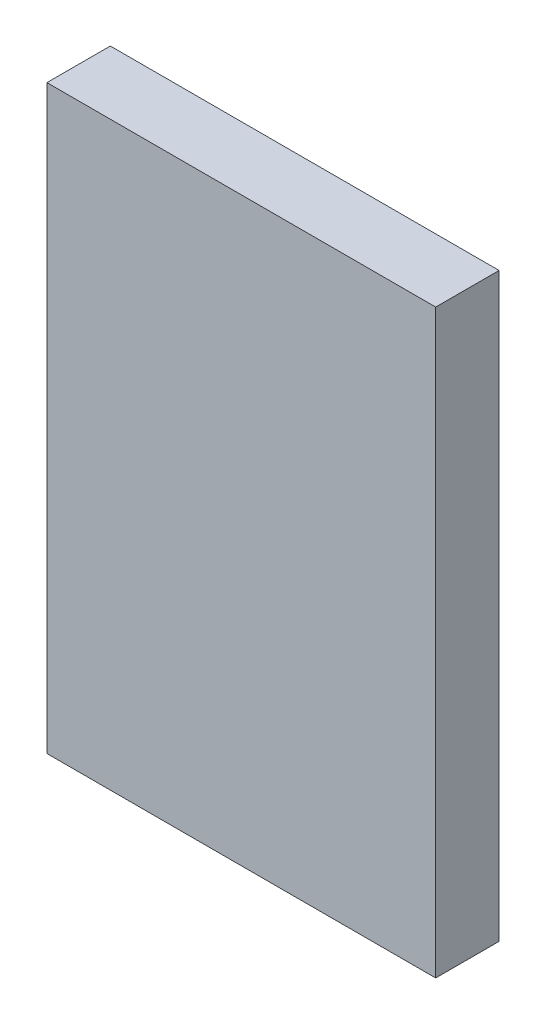
ISO-10303-21;
HEADER;
FILE_DESCRIPTION(('STEP AP214'),'2;1');
FILE_NAME('part.step','',(''),(''),'','','');
FILE_SCHEMA(('AUTOMOTIVE_DESIGN { 1 0 10303 214 1 1 1 1 }'));
ENDSEC;
DATA;
#1=APPLICATION_CONTEXT('core data for automotive mechanical design processes');
#2=APPLICATION_PROTOCOL_DEFINITION('international standard','automotive_design',2000,#1);
#3=PRODUCT_CONTEXT('',#1,'mechanical');
#4=PRODUCT('Part','Part','',(#3));
#5=PRODUCT_RELATED_PRODUCT_CATEGORY('part','',(#4));
#6=PRODUCT_DEFINITION_FORMATION('','',#4);
#7=PRODUCT_DEFINITION_CONTEXT('part definition',#1,'design');
#8=PRODUCT_DEFINITION('design','',#6,#7);
#9=PRODUCT_DEFINITION_SHAPE('','',#8);
#10=(LENGTH_UNIT() NAMED_UNIT(*) SI_UNIT(.MILLI.,.METRE.));
#11=(NAMED_UNIT(*) PLANE_ANGLE_UNIT() SI_UNIT($,.RADIAN.));
#12=(NAMED_UNIT(*) SI_UNIT($,.STERADIAN.) SOLID_ANGLE_UNIT());
#13=UNCERTAINTY_MEASURE_WITH_UNIT(LENGTH_MEASURE(1.E-05),#10,'distance_accuracy_value','');
#14=(GEOMETRIC_REPRESENTATION_CONTEXT(3) GLOBAL_UNCERTAINTY_ASSIGNED_CONTEXT((#13)) GLOBAL_UNIT_ASSIGNED_CONTEXT((#10,
#11,#12)) REPRESENTATION_CONTEXT('',''));
#15=CARTESIAN_POINT('',(0.,0.,0.));
#16=DIRECTION('',(0.,0.,1.));
#17=DIRECTION('',(1.,0.,0.));
#18=AXIS2_PLACEMENT_3D('',#15,#16,#17);
#19=CARTESIAN_POINT('',(27.6,-41.25,9.));
#20=DIRECTION('',(-1.,0.,0.));
#21=DIRECTION('',(0.,0.,1.));
#22=AXIS2_PLACEMENT_3D('',#19,#20,#21);
#23=PLANE('',#22);
#24=DIRECTION('',(0.,1.,0.));
#25=VECTOR('',#24,1.);
#26=CARTESIAN_POINT('',(27.6,-41.25,0.));
#27=LINE('',#26,#25);
#28=CARTESIAN_POINT('',(27.6,-41.25,0.));
#29=VERTEX_POINT('',#28);
#30=CARTESIAN_POINT('',(27.6,41.25,0.));
#31=VERTEX_POINT('',#30);
#32=EDGE_CURVE('E96',#29,#31,#27,.T.);
#33=ORIENTED_EDGE('',*,*,#32,.T.);
#34=DIRECTION('',(0.,0.,-1.));
#35=VECTOR('',#34,1.);
#36=CARTESIAN_POINT('',(27.6,41.25,9.));
#37=LINE('',#36,#35);
#38=CARTESIAN_POINT('',(27.6,41.25,9.));
#39=VERTEX_POINT('',#38);
#40=EDGE_CURVE('E11',#39,#31,#37,.T.);
#41=ORIENTED_EDGE('',*,*,#40,.F.);
#42=DIRECTION('',(0.,1.,0.));
#43=VECTOR('',#42,1.);
#44=CARTESIAN_POINT('',(27.6,-41.25,9.));
#45=LINE('',#44,#43);
#46=CARTESIAN_POINT('',(27.6,-41.25,9.));
#47=VERTEX_POINT('',#46);
#48=EDGE_CURVE('E84',#47,#39,#45,.T.);
#49=ORIENTED_EDGE('',*,*,#48,.F.);
#50=DIRECTION('',(0.,0.,-1.));
#51=VECTOR('',#50,1.);
#52=CARTESIAN_POINT('',(27.6,-41.25,9.));
#53=LINE('',#52,#51);
#54=EDGE_CURVE('E92',#47,#29,#53,.T.);
#55=ORIENTED_EDGE('',*,*,#54,.T.);
#56=EDGE_LOOP('',(#33,#41,#49,#55));
#57=FACE_BOUND('',#56,.T.);
#58=ADVANCED_FACE('F33',(#57),#23,.F.);
#59=CARTESIAN_POINT('',(-27.6,41.25,9.));
#60=DIRECTION('',(0.,-1.,0.));
#61=DIRECTION('',(0.,0.,-1.));
#62=AXIS2_PLACEMENT_3D('',#59,#60,#61);
#63=PLANE('',#62);
#64=DIRECTION('',(-1.,0.,0.));
#65=VECTOR('',#64,1.);
#66=CARTESIAN_POINT('',(-27.6,41.25,0.));
#67=LINE('',#66,#65);
#68=CARTESIAN_POINT('',(-27.6,41.25,0.));
#69=VERTEX_POINT('',#68);
#70=EDGE_CURVE('E88',#31,#69,#67,.T.);
#71=ORIENTED_EDGE('',*,*,#70,.T.);
#72=DIRECTION('',(0.,0.,-1.));
#73=VECTOR('',#72,1.);
#74=CARTESIAN_POINT('',(-27.6,41.25,9.));
#75=LINE('',#74,#73);
#76=CARTESIAN_POINT('',(-27.6,41.25,9.));
#77=VERTEX_POINT('',#76);
#78=EDGE_CURVE('E41',#77,#69,#75,.T.);
#79=ORIENTED_EDGE('',*,*,#78,.F.);
#80=DIRECTION('',(-1.,0.,0.));
#81=VECTOR('',#80,1.);
#82=CARTESIAN_POINT('',(-27.6,41.25,9.));
#83=LINE('',#82,#81);
#84=EDGE_CURVE('E79',#39,#77,#83,.T.);
#85=ORIENTED_EDGE('',*,*,#84,.F.);
#86=ORIENTED_EDGE('',*,*,#40,.T.);
#87=EDGE_LOOP('',(#71,#79,#85,#86));
#88=FACE_BOUND('',#87,.T.);
#89=ADVANCED_FACE('F87',(#88),#63,.F.);
#90=CARTESIAN_POINT('',(-27.6,-41.25,9.));
#91=DIRECTION('',(1.,0.,0.));
#92=DIRECTION('',(0.,0.,-1.));
#93=AXIS2_PLACEMENT_3D('',#90,#91,#92);
#94=PLANE('',#93);
#95=DIRECTION('',(0.,-1.,0.));
#96=VECTOR('',#95,1.);
#97=CARTESIAN_POINT('',(-27.6,-41.25,0.));
#98=LINE('',#97,#96);
#99=CARTESIAN_POINT('',(-27.6,-41.25,0.));
#100=VERTEX_POINT('',#99);
#101=EDGE_CURVE('E66',#69,#100,#98,.T.);
#102=ORIENTED_EDGE('',*,*,#101,.T.);
#103=DIRECTION('',(0.,0.,-1.));
#104=VECTOR('',#103,1.);
#105=CARTESIAN_POINT('',(-27.6,-41.25,9.));
#106=LINE('',#105,#104);
#107=CARTESIAN_POINT('',(-27.6,-41.25,9.));
#108=VERTEX_POINT('',#107);
#109=EDGE_CURVE('E89',#108,#100,#106,.T.);
#110=ORIENTED_EDGE('',*,*,#109,.F.);
#111=DIRECTION('',(0.,-1.,0.));
#112=VECTOR('',#111,1.);
#113=CARTESIAN_POINT('',(-27.6,-41.25,9.));
#114=LINE('',#113,#112);
#115=EDGE_CURVE('E82',#77,#108,#114,.T.);
#116=ORIENTED_EDGE('',*,*,#115,.F.);
#117=ORIENTED_EDGE('',*,*,#78,.T.);
#118=EDGE_LOOP('',(#102,#110,#116,#117));
#119=FACE_BOUND('',#118,.T.);
#120=ADVANCED_FACE('F90',(#119),#94,.F.);
#121=CARTESIAN_POINT('',(-27.6,-41.25,9.));
#122=DIRECTION('',(0.,1.,0.));
#123=DIRECTION('',(0.,0.,1.));
#124=AXIS2_PLACEMENT_3D('',#121,#122,#123);
#125=PLANE('',#124);
#126=DIRECTION('',(1.,0.,0.));
#127=VECTOR('',#126,1.);
#128=CARTESIAN_POINT('',(-27.6,-41.25,0.));
#129=LINE('',#128,#127);
#130=EDGE_CURVE('E72',#100,#29,#129,.T.);
#131=ORIENTED_EDGE('',*,*,#130,.T.);
#132=ORIENTED_EDGE('',*,*,#54,.F.);
#133=DIRECTION('',(1.,0.,0.));
#134=VECTOR('',#133,1.);
#135=CARTESIAN_POINT('',(-27.6,-41.25,9.));
#136=LINE('',#135,#134);
#137=EDGE_CURVE('E49',#108,#47,#136,.T.);
#138=ORIENTED_EDGE('',*,*,#137,.F.);
#139=ORIENTED_EDGE('',*,*,#109,.T.);
#140=EDGE_LOOP('',(#131,#132,#138,#139));
#141=FACE_BOUND('',#140,.T.);
#142=ADVANCED_FACE('F103',(#141),#125,.F.);
#143=CARTESIAN_POINT('',(0.,0.,9.));
#144=DIRECTION('',(0.,0.,-1.));
#145=DIRECTION('',(-1.,0.,0.));
#146=AXIS2_PLACEMENT_3D('',#143,#144,#145);
#147=PLANE('',#146);
#148=ORIENTED_EDGE('',*,*,#48,.T.);
#149=ORIENTED_EDGE('',*,*,#84,.T.);
#150=ORIENTED_EDGE('',*,*,#115,.T.);
#151=ORIENTED_EDGE('',*,*,#137,.T.);
#152=EDGE_LOOP('',(#148,#149,#150,#151));
#153=FACE_BOUND('',#152,.T.);
#154=ADVANCED_FACE('F80',(#153),#147,.F.);
#155=CARTESIAN_POINT('',(0.,0.,0.));
#156=DIRECTION('',(0.,0.,-1.));
#157=DIRECTION('',(-1.,0.,0.));
#158=AXIS2_PLACEMENT_3D('',#155,#156,#157);
#159=PLANE('',#158);
#160=ORIENTED_EDGE('',*,*,#32,.F.);
#161=ORIENTED_EDGE('',*,*,#130,.F.);
#162=ORIENTED_EDGE('',*,*,#101,.F.);
#163=ORIENTED_EDGE('',*,*,#70,.F.);
#164=EDGE_LOOP('',(#160,#161,#162,#163));
#165=FACE_BOUND('',#164,.T.);
#166=ADVANCED_FACE('F106',(#165),#159,.T.);
#167=CLOSED_SHELL('',(#58,#89,#120,#142,#154,#166));
#168=MANIFOLD_SOLID_BREP('B2',#167);
#169=ADVANCED_BREP_SHAPE_REPRESENTATION('',(#18,#168),#14);
#170=SHAPE_DEFINITION_REPRESENTATION(#9,#169);
ENDSEC;
END-ISO-10303-21;
